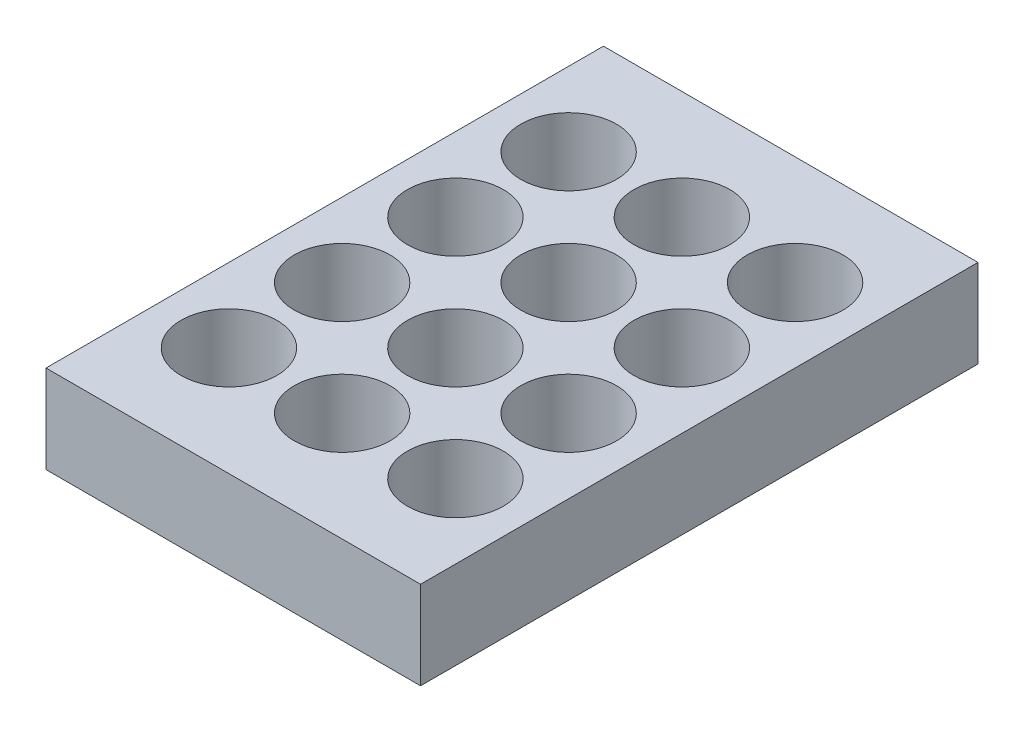
ISO-10303-21;
HEADER;
FILE_DESCRIPTION(('STEP AP214'),'2;1');
FILE_NAME('part.step','',(''),(''),'','','');
FILE_SCHEMA(('AUTOMOTIVE_DESIGN { 1 0 10303 214 1 1 1 1 }'));
ENDSEC;
DATA;
#1=APPLICATION_CONTEXT('core data for automotive mechanical design processes');
#2=APPLICATION_PROTOCOL_DEFINITION('international standard','automotive_design',2000,#1);
#3=PRODUCT_CONTEXT('',#1,'mechanical');
#4=PRODUCT('Part','Part','',(#3));
#5=PRODUCT_RELATED_PRODUCT_CATEGORY('part','',(#4));
#6=PRODUCT_DEFINITION_FORMATION('','',#4);
#7=PRODUCT_DEFINITION_CONTEXT('part definition',#1,'design');
#8=PRODUCT_DEFINITION('design','',#6,#7);
#9=PRODUCT_DEFINITION_SHAPE('','',#8);
#10=(LENGTH_UNIT() NAMED_UNIT(*) SI_UNIT(.MILLI.,.METRE.));
#11=(NAMED_UNIT(*) PLANE_ANGLE_UNIT() SI_UNIT($,.RADIAN.));
#12=(NAMED_UNIT(*) SI_UNIT($,.STERADIAN.) SOLID_ANGLE_UNIT());
#13=UNCERTAINTY_MEASURE_WITH_UNIT(LENGTH_MEASURE(1.E-05),#10,'distance_accuracy_value','');
#14=(GEOMETRIC_REPRESENTATION_CONTEXT(3) GLOBAL_UNCERTAINTY_ASSIGNED_CONTEXT((#13)) GLOBAL_UNIT_ASSIGNED_CONTEXT((#10,
#11,#12)) REPRESENTATION_CONTEXT('',''));
#15=CARTESIAN_POINT('',(0.,0.,0.));
#16=DIRECTION('',(0.,0.,1.));
#17=DIRECTION('',(1.,0.,0.));
#18=AXIS2_PLACEMENT_3D('',#15,#16,#17);
#19=CARTESIAN_POINT('',(69.,2.5,-103.));
#20=DIRECTION('',(0.,1.,0.));
#21=DIRECTION('',(0.,0.,1.));
#22=AXIS2_PLACEMENT_3D('',#19,#20,#21);
#23=PLANE('',#22);
#24=CARTESIAN_POINT('',(69.,2.5,-103.));
#25=DIRECTION('',(0.,1.,0.));
#26=DIRECTION('',(0.,0.,1.));
#27=AXIS2_PLACEMENT_3D('',#24,#25,#26);
#28=CIRCLE('',#27,11.);
#29=CARTESIAN_POINT('',(69.,2.5,-92.));
#30=VERTEX_POINT('',#29);
#31=EDGE_CURVE('E41',#30,#30,#28,.T.);
#32=ORIENTED_EDGE('',*,*,#31,.T.);
#33=EDGE_LOOP('',(#32));
#34=FACE_BOUND('',#33,.T.);
#35=ADVANCED_FACE('F33',(#34),#23,.T.);
#36=CARTESIAN_POINT('',(69.,2.5,-103.));
#37=DIRECTION('',(0.,1.,0.));
#38=DIRECTION('',(0.,0.,1.));
#39=AXIS2_PLACEMENT_3D('',#36,#37,#38);
#40=CYLINDRICAL_SURFACE('',#39,11.);
#41=ORIENTED_EDGE('',*,*,#31,.F.);
#42=EDGE_LOOP('',(#41));
#43=FACE_BOUND('',#42,.T.);
#44=CARTESIAN_POINT('',(69.,20.2,-103.));
#45=DIRECTION('',(0.,1.,0.));
#46=DIRECTION('',(0.,0.,1.));
#47=AXIS2_PLACEMENT_3D('',#44,#45,#46);
#48=CIRCLE('',#47,11.);
#49=CARTESIAN_POINT('',(69.,20.2,-92.));
#50=VERTEX_POINT('',#49);
#51=EDGE_CURVE('E11',#50,#50,#48,.T.);
#52=ORIENTED_EDGE('',*,*,#51,.T.);
#53=EDGE_LOOP('',(#52));
#54=FACE_BOUND('',#53,.T.);
#55=ADVANCED_FACE('F173',(#43,#54),#40,.F.);
#56=CARTESIAN_POINT('',(69.,2.5,-77.));
#57=DIRECTION('',(0.,1.,0.));
#58=DIRECTION('',(0.,0.,1.));
#59=AXIS2_PLACEMENT_3D('',#56,#57,#58);
#60=PLANE('',#59);
#61=CARTESIAN_POINT('',(69.,2.5,-77.));
#62=DIRECTION('',(0.,1.,0.));
#63=DIRECTION('',(0.,0.,1.));
#64=AXIS2_PLACEMENT_3D('',#61,#62,#63);
#65=CIRCLE('',#64,11.);
#66=CARTESIAN_POINT('',(69.,2.5,-66.));
#67=VERTEX_POINT('',#66);
#68=EDGE_CURVE('E164',#67,#67,#65,.T.);
#69=ORIENTED_EDGE('',*,*,#68,.T.);
#70=EDGE_LOOP('',(#69));
#71=FACE_BOUND('',#70,.T.);
#72=ADVANCED_FACE('F176',(#71),#60,.T.);
#73=CARTESIAN_POINT('',(69.,2.5,-77.));
#74=DIRECTION('',(0.,1.,0.));
#75=DIRECTION('',(0.,0.,1.));
#76=AXIS2_PLACEMENT_3D('',#73,#74,#75);
#77=CYLINDRICAL_SURFACE('',#76,11.);
#78=ORIENTED_EDGE('',*,*,#68,.F.);
#79=EDGE_LOOP('',(#78));
#80=FACE_BOUND('',#79,.T.);
#81=CARTESIAN_POINT('',(69.,20.2,-77.));
#82=DIRECTION('',(0.,1.,0.));
#83=DIRECTION('',(0.,0.,1.));
#84=AXIS2_PLACEMENT_3D('',#81,#82,#83);
#85=CIRCLE('',#84,11.);
#86=CARTESIAN_POINT('',(69.,20.2,-66.));
#87=VERTEX_POINT('',#86);
#88=EDGE_CURVE('E167',#87,#87,#85,.T.);
#89=ORIENTED_EDGE('',*,*,#88,.T.);
#90=EDGE_LOOP('',(#89));
#91=FACE_BOUND('',#90,.T.);
#92=ADVANCED_FACE('F239',(#80,#91),#77,.F.);
#93=CARTESIAN_POINT('',(69.,2.5,-51.));
#94=DIRECTION('',(0.,1.,0.));
#95=DIRECTION('',(0.,0.,1.));
#96=AXIS2_PLACEMENT_3D('',#93,#94,#95);
#97=PLANE('',#96);
#98=CARTESIAN_POINT('',(69.,2.5,-51.));
#99=DIRECTION('',(0.,1.,0.));
#100=DIRECTION('',(0.,0.,1.));
#101=AXIS2_PLACEMENT_3D('',#98,#99,#100);
#102=CIRCLE('',#101,11.);
#103=CARTESIAN_POINT('',(69.,2.5,-40.));
#104=VERTEX_POINT('',#103);
#105=EDGE_CURVE('E158',#104,#104,#102,.T.);
#106=ORIENTED_EDGE('',*,*,#105,.T.);
#107=EDGE_LOOP('',(#106));
#108=FACE_BOUND('',#107,.T.);
#109=ADVANCED_FACE('F247',(#108),#97,.T.);
#110=CARTESIAN_POINT('',(69.,2.5,-51.));
#111=DIRECTION('',(0.,1.,0.));
#112=DIRECTION('',(0.,0.,1.));
#113=AXIS2_PLACEMENT_3D('',#110,#111,#112);
#114=CYLINDRICAL_SURFACE('',#113,11.);
#115=ORIENTED_EDGE('',*,*,#105,.F.);
#116=EDGE_LOOP('',(#115));
#117=FACE_BOUND('',#116,.T.);
#118=CARTESIAN_POINT('',(69.,20.2,-51.));
#119=DIRECTION('',(0.,1.,0.));
#120=DIRECTION('',(0.,0.,1.));
#121=AXIS2_PLACEMENT_3D('',#118,#119,#120);
#122=CIRCLE('',#121,11.);
#123=CARTESIAN_POINT('',(69.,20.2,-40.));
#124=VERTEX_POINT('',#123);
#125=EDGE_CURVE('E161',#124,#124,#122,.T.);
#126=ORIENTED_EDGE('',*,*,#125,.T.);
#127=EDGE_LOOP('',(#126));
#128=FACE_BOUND('',#127,.T.);
#129=ADVANCED_FACE('F255',(#117,#128),#114,.F.);
#130=CARTESIAN_POINT('',(69.,2.5,-25.));
#131=DIRECTION('',(0.,1.,0.));
#132=DIRECTION('',(0.,0.,1.));
#133=AXIS2_PLACEMENT_3D('',#130,#131,#132);
#134=PLANE('',#133);
#135=CARTESIAN_POINT('',(69.,2.5,-25.));
#136=DIRECTION('',(0.,1.,0.));
#137=DIRECTION('',(0.,0.,1.));
#138=AXIS2_PLACEMENT_3D('',#135,#136,#137);
#139=CIRCLE('',#138,11.);
#140=CARTESIAN_POINT('',(69.,2.5,-14.));
#141=VERTEX_POINT('',#140);
#142=EDGE_CURVE('E152',#141,#141,#139,.T.);
#143=ORIENTED_EDGE('',*,*,#142,.T.);
#144=EDGE_LOOP('',(#143));
#145=FACE_BOUND('',#144,.T.);
#146=ADVANCED_FACE('F263',(#145),#134,.T.);
#147=CARTESIAN_POINT('',(69.,2.5,-25.));
#148=DIRECTION('',(0.,1.,0.));
#149=DIRECTION('',(0.,0.,1.));
#150=AXIS2_PLACEMENT_3D('',#147,#148,#149);
#151=CYLINDRICAL_SURFACE('',#150,11.);
#152=ORIENTED_EDGE('',*,*,#142,.F.);
#153=EDGE_LOOP('',(#152));
#154=FACE_BOUND('',#153,.T.);
#155=CARTESIAN_POINT('',(69.,20.2,-25.));
#156=DIRECTION('',(0.,1.,0.));
#157=DIRECTION('',(0.,0.,1.));
#158=AXIS2_PLACEMENT_3D('',#155,#156,#157);
#159=CIRCLE('',#158,11.);
#160=CARTESIAN_POINT('',(69.,20.2,-14.));
#161=VERTEX_POINT('',#160);
#162=EDGE_CURVE('E155',#161,#161,#159,.T.);
#163=ORIENTED_EDGE('',*,*,#162,.T.);
#164=EDGE_LOOP('',(#163));
#165=FACE_BOUND('',#164,.T.);
#166=ADVANCED_FACE('F271',(#154,#165),#151,.F.);
#167=CARTESIAN_POINT('',(43.,2.5,-103.));
#168=DIRECTION('',(0.,1.,0.));
#169=DIRECTION('',(0.,0.,1.));
#170=AXIS2_PLACEMENT_3D('',#167,#168,#169);
#171=PLANE('',#170);
#172=CARTESIAN_POINT('',(43.,2.5,-103.));
#173=DIRECTION('',(0.,1.,0.));
#174=DIRECTION('',(0.,0.,1.));
#175=AXIS2_PLACEMENT_3D('',#172,#173,#174);
#176=CIRCLE('',#175,11.);
#177=CARTESIAN_POINT('',(43.,2.5,-92.));
#178=VERTEX_POINT('',#177);
#179=EDGE_CURVE('E146',#178,#178,#176,.T.);
#180=ORIENTED_EDGE('',*,*,#179,.T.);
#181=EDGE_LOOP('',(#180));
#182=FACE_BOUND('',#181,.T.);
#183=ADVANCED_FACE('F279',(#182),#171,.T.);
#184=CARTESIAN_POINT('',(43.,2.5,-103.));
#185=DIRECTION('',(0.,1.,0.));
#186=DIRECTION('',(0.,0.,1.));
#187=AXIS2_PLACEMENT_3D('',#184,#185,#186);
#188=CYLINDRICAL_SURFACE('',#187,11.);
#189=ORIENTED_EDGE('',*,*,#179,.F.);
#190=EDGE_LOOP('',(#189));
#191=FACE_BOUND('',#190,.T.);
#192=CARTESIAN_POINT('',(43.,20.2,-103.));
#193=DIRECTION('',(0.,1.,0.));
#194=DIRECTION('',(0.,0.,1.));
#195=AXIS2_PLACEMENT_3D('',#192,#193,#194);
#196=CIRCLE('',#195,11.);
#197=CARTESIAN_POINT('',(43.,20.2,-92.));
#198=VERTEX_POINT('',#197);
#199=EDGE_CURVE('E149',#198,#198,#196,.T.);
#200=ORIENTED_EDGE('',*,*,#199,.T.);
#201=EDGE_LOOP('',(#200));
#202=FACE_BOUND('',#201,.T.);
#203=ADVANCED_FACE('F287',(#191,#202),#188,.F.);
#204=CARTESIAN_POINT('',(43.,2.5,-77.));
#205=DIRECTION('',(0.,1.,0.));
#206=DIRECTION('',(0.,0.,1.));
#207=AXIS2_PLACEMENT_3D('',#204,#205,#206);
#208=PLANE('',#207);
#209=CARTESIAN_POINT('',(43.,2.5,-77.));
#210=DIRECTION('',(0.,1.,0.));
#211=DIRECTION('',(0.,0.,1.));
#212=AXIS2_PLACEMENT_3D('',#209,#210,#211);
#213=CIRCLE('',#212,11.);
#214=CARTESIAN_POINT('',(43.,2.5,-66.));
#215=VERTEX_POINT('',#214);
#216=EDGE_CURVE('E140',#215,#215,#213,.T.);
#217=ORIENTED_EDGE('',*,*,#216,.T.);
#218=EDGE_LOOP('',(#217));
#219=FACE_BOUND('',#218,.T.);
#220=ADVANCED_FACE('F295',(#219),#208,.T.);
#221=CARTESIAN_POINT('',(43.,2.5,-77.));
#222=DIRECTION('',(0.,1.,0.));
#223=DIRECTION('',(0.,0.,1.));
#224=AXIS2_PLACEMENT_3D('',#221,#222,#223);
#225=CYLINDRICAL_SURFACE('',#224,11.);
#226=ORIENTED_EDGE('',*,*,#216,.F.);
#227=EDGE_LOOP('',(#226));
#228=FACE_BOUND('',#227,.T.);
#229=CARTESIAN_POINT('',(43.,20.2,-77.));
#230=DIRECTION('',(0.,1.,0.));
#231=DIRECTION('',(0.,0.,1.));
#232=AXIS2_PLACEMENT_3D('',#229,#230,#231);
#233=CIRCLE('',#232,11.);
#234=CARTESIAN_POINT('',(43.,20.2,-66.));
#235=VERTEX_POINT('',#234);
#236=EDGE_CURVE('E143',#235,#235,#233,.T.);
#237=ORIENTED_EDGE('',*,*,#236,.T.);
#238=EDGE_LOOP('',(#237));
#239=FACE_BOUND('',#238,.T.);
#240=ADVANCED_FACE('F303',(#228,#239),#225,.F.);
#241=CARTESIAN_POINT('',(43.,2.5,-51.));
#242=DIRECTION('',(0.,1.,0.));
#243=DIRECTION('',(0.,0.,1.));
#244=AXIS2_PLACEMENT_3D('',#241,#242,#243);
#245=PLANE('',#244);
#246=CARTESIAN_POINT('',(43.,2.5,-51.));
#247=DIRECTION('',(0.,1.,0.));
#248=DIRECTION('',(0.,0.,1.));
#249=AXIS2_PLACEMENT_3D('',#246,#247,#248);
#250=CIRCLE('',#249,11.);
#251=CARTESIAN_POINT('',(43.,2.5,-40.));
#252=VERTEX_POINT('',#251);
#253=EDGE_CURVE('E134',#252,#252,#250,.T.);
#254=ORIENTED_EDGE('',*,*,#253,.T.);
#255=EDGE_LOOP('',(#254));
#256=FACE_BOUND('',#255,.T.);
#257=ADVANCED_FACE('F311',(#256),#245,.T.);
#258=CARTESIAN_POINT('',(43.,2.5,-51.));
#259=DIRECTION('',(0.,1.,0.));
#260=DIRECTION('',(0.,0.,1.));
#261=AXIS2_PLACEMENT_3D('',#258,#259,#260);
#262=CYLINDRICAL_SURFACE('',#261,11.);
#263=ORIENTED_EDGE('',*,*,#253,.F.);
#264=EDGE_LOOP('',(#263));
#265=FACE_BOUND('',#264,.T.);
#266=CARTESIAN_POINT('',(43.,20.2,-51.));
#267=DIRECTION('',(0.,1.,0.));
#268=DIRECTION('',(0.,0.,1.));
#269=AXIS2_PLACEMENT_3D('',#266,#267,#268);
#270=CIRCLE('',#269,11.);
#271=CARTESIAN_POINT('',(43.,20.2,-40.));
#272=VERTEX_POINT('',#271);
#273=EDGE_CURVE('E137',#272,#272,#270,.T.);
#274=ORIENTED_EDGE('',*,*,#273,.T.);
#275=EDGE_LOOP('',(#274));
#276=FACE_BOUND('',#275,.T.);
#277=ADVANCED_FACE('F319',(#265,#276),#262,.F.);
#278=CARTESIAN_POINT('',(43.,2.5,-25.));
#279=DIRECTION('',(0.,1.,0.));
#280=DIRECTION('',(0.,0.,1.));
#281=AXIS2_PLACEMENT_3D('',#278,#279,#280);
#282=PLANE('',#281);
#283=CARTESIAN_POINT('',(43.,2.5,-25.));
#284=DIRECTION('',(0.,1.,0.));
#285=DIRECTION('',(0.,0.,1.));
#286=AXIS2_PLACEMENT_3D('',#283,#284,#285);
#287=CIRCLE('',#286,11.);
#288=CARTESIAN_POINT('',(43.,2.5,-14.));
#289=VERTEX_POINT('',#288);
#290=EDGE_CURVE('E128',#289,#289,#287,.T.);
#291=ORIENTED_EDGE('',*,*,#290,.T.);
#292=EDGE_LOOP('',(#291));
#293=FACE_BOUND('',#292,.T.);
#294=ADVANCED_FACE('F327',(#293),#282,.T.);
#295=CARTESIAN_POINT('',(43.,2.5,-25.));
#296=DIRECTION('',(0.,1.,0.));
#297=DIRECTION('',(0.,0.,1.));
#298=AXIS2_PLACEMENT_3D('',#295,#296,#297);
#299=CYLINDRICAL_SURFACE('',#298,11.);
#300=ORIENTED_EDGE('',*,*,#290,.F.);
#301=EDGE_LOOP('',(#300));
#302=FACE_BOUND('',#301,.T.);
#303=CARTESIAN_POINT('',(43.,20.2,-25.));
#304=DIRECTION('',(0.,1.,0.));
#305=DIRECTION('',(0.,0.,1.));
#306=AXIS2_PLACEMENT_3D('',#303,#304,#305);
#307=CIRCLE('',#306,11.);
#308=CARTESIAN_POINT('',(43.,20.2,-14.));
#309=VERTEX_POINT('',#308);
#310=EDGE_CURVE('E131',#309,#309,#307,.T.);
#311=ORIENTED_EDGE('',*,*,#310,.T.);
#312=EDGE_LOOP('',(#311));
#313=FACE_BOUND('',#312,.T.);
#314=ADVANCED_FACE('F335',(#302,#313),#299,.F.);
#315=CARTESIAN_POINT('',(17.,2.5,-103.));
#316=DIRECTION('',(0.,1.,0.));
#317=DIRECTION('',(0.,0.,1.));
#318=AXIS2_PLACEMENT_3D('',#315,#316,#317);
#319=PLANE('',#318);
#320=CARTESIAN_POINT('',(17.,2.5,-103.));
#321=DIRECTION('',(0.,1.,0.));
#322=DIRECTION('',(0.,0.,1.));
#323=AXIS2_PLACEMENT_3D('',#320,#321,#322);
#324=CIRCLE('',#323,11.);
#325=CARTESIAN_POINT('',(17.,2.5,-92.));
#326=VERTEX_POINT('',#325);
#327=EDGE_CURVE('E122',#326,#326,#324,.T.);
#328=ORIENTED_EDGE('',*,*,#327,.T.);
#329=EDGE_LOOP('',(#328));
#330=FACE_BOUND('',#329,.T.);
#331=ADVANCED_FACE('F343',(#330),#319,.T.);
#332=CARTESIAN_POINT('',(17.,2.5,-103.));
#333=DIRECTION('',(0.,1.,0.));
#334=DIRECTION('',(0.,0.,1.));
#335=AXIS2_PLACEMENT_3D('',#332,#333,#334);
#336=CYLINDRICAL_SURFACE('',#335,11.);
#337=ORIENTED_EDGE('',*,*,#327,.F.);
#338=EDGE_LOOP('',(#337));
#339=FACE_BOUND('',#338,.T.);
#340=CARTESIAN_POINT('',(17.,20.2,-103.));
#341=DIRECTION('',(0.,1.,0.));
#342=DIRECTION('',(0.,0.,1.));
#343=AXIS2_PLACEMENT_3D('',#340,#341,#342);
#344=CIRCLE('',#343,11.);
#345=CARTESIAN_POINT('',(17.,20.2,-92.));
#346=VERTEX_POINT('',#345);
#347=EDGE_CURVE('E125',#346,#346,#344,.T.);
#348=ORIENTED_EDGE('',*,*,#347,.T.);
#349=EDGE_LOOP('',(#348));
#350=FACE_BOUND('',#349,.T.);
#351=ADVANCED_FACE('F351',(#339,#350),#336,.F.);
#352=CARTESIAN_POINT('',(17.,2.5,-77.));
#353=DIRECTION('',(0.,1.,0.));
#354=DIRECTION('',(0.,0.,1.));
#355=AXIS2_PLACEMENT_3D('',#352,#353,#354);
#356=PLANE('',#355);
#357=CARTESIAN_POINT('',(17.,2.5,-77.));
#358=DIRECTION('',(0.,1.,0.));
#359=DIRECTION('',(0.,0.,1.));
#360=AXIS2_PLACEMENT_3D('',#357,#358,#359);
#361=CIRCLE('',#360,11.);
#362=CARTESIAN_POINT('',(17.,2.5,-66.));
#363=VERTEX_POINT('',#362);
#364=EDGE_CURVE('E116',#363,#363,#361,.T.);
#365=ORIENTED_EDGE('',*,*,#364,.T.);
#366=EDGE_LOOP('',(#365));
#367=FACE_BOUND('',#366,.T.);
#368=ADVANCED_FACE('F359',(#367),#356,.T.);
#369=CARTESIAN_POINT('',(17.,2.5,-77.));
#370=DIRECTION('',(0.,1.,0.));
#371=DIRECTION('',(0.,0.,1.));
#372=AXIS2_PLACEMENT_3D('',#369,#370,#371);
#373=CYLINDRICAL_SURFACE('',#372,11.);
#374=ORIENTED_EDGE('',*,*,#364,.F.);
#375=EDGE_LOOP('',(#374));
#376=FACE_BOUND('',#375,.T.);
#377=CARTESIAN_POINT('',(17.,20.2,-77.));
#378=DIRECTION('',(0.,1.,0.));
#379=DIRECTION('',(0.,0.,1.));
#380=AXIS2_PLACEMENT_3D('',#377,#378,#379);
#381=CIRCLE('',#380,11.);
#382=CARTESIAN_POINT('',(17.,20.2,-66.));
#383=VERTEX_POINT('',#382);
#384=EDGE_CURVE('E119',#383,#383,#381,.T.);
#385=ORIENTED_EDGE('',*,*,#384,.T.);
#386=EDGE_LOOP('',(#385));
#387=FACE_BOUND('',#386,.T.);
#388=ADVANCED_FACE('F367',(#376,#387),#373,.F.);
#389=CARTESIAN_POINT('',(17.,2.5,-51.));
#390=DIRECTION('',(0.,1.,0.));
#391=DIRECTION('',(0.,0.,1.));
#392=AXIS2_PLACEMENT_3D('',#389,#390,#391);
#393=PLANE('',#392);
#394=CARTESIAN_POINT('',(17.,2.5,-51.));
#395=DIRECTION('',(0.,1.,0.));
#396=DIRECTION('',(0.,0.,1.));
#397=AXIS2_PLACEMENT_3D('',#394,#395,#396);
#398=CIRCLE('',#397,11.);
#399=CARTESIAN_POINT('',(17.,2.5,-40.));
#400=VERTEX_POINT('',#399);
#401=EDGE_CURVE('E110',#400,#400,#398,.T.);
#402=ORIENTED_EDGE('',*,*,#401,.T.);
#403=EDGE_LOOP('',(#402));
#404=FACE_BOUND('',#403,.T.);
#405=ADVANCED_FACE('F375',(#404),#393,.T.);
#406=CARTESIAN_POINT('',(17.,2.5,-51.));
#407=DIRECTION('',(0.,1.,0.));
#408=DIRECTION('',(0.,0.,1.));
#409=AXIS2_PLACEMENT_3D('',#406,#407,#408);
#410=CYLINDRICAL_SURFACE('',#409,11.);
#411=ORIENTED_EDGE('',*,*,#401,.F.);
#412=EDGE_LOOP('',(#411));
#413=FACE_BOUND('',#412,.T.);
#414=CARTESIAN_POINT('',(17.,20.2,-51.));
#415=DIRECTION('',(0.,1.,0.));
#416=DIRECTION('',(0.,0.,1.));
#417=AXIS2_PLACEMENT_3D('',#414,#415,#416);
#418=CIRCLE('',#417,11.);
#419=CARTESIAN_POINT('',(17.,20.2,-40.));
#420=VERTEX_POINT('',#419);
#421=EDGE_CURVE('E113',#420,#420,#418,.T.);
#422=ORIENTED_EDGE('',*,*,#421,.T.);
#423=EDGE_LOOP('',(#422));
#424=FACE_BOUND('',#423,.T.);
#425=ADVANCED_FACE('F383',(#413,#424),#410,.F.);
#426=CARTESIAN_POINT('',(0.,20.2,0.));
#427=DIRECTION('',(1.,0.,0.));
#428=DIRECTION('',(0.,0.,-1.));
#429=AXIS2_PLACEMENT_3D('',#426,#427,#428);
#430=PLANE('',#429);
#431=DIRECTION('',(0.,0.,1.));
#432=VECTOR('',#431,1.);
#433=CARTESIAN_POINT('',(0.,0.,0.));
#434=LINE('',#433,#432);
#435=CARTESIAN_POINT('',(0.,0.,-128.));
#436=VERTEX_POINT('',#435);
#437=CARTESIAN_POINT('',(0.,0.,0.));
#438=VERTEX_POINT('',#437);
#439=EDGE_CURVE('E100',#436,#438,#434,.T.);
#440=ORIENTED_EDGE('',*,*,#439,.T.);
#441=DIRECTION('',(0.,-1.,0.));
#442=VECTOR('',#441,1.);
#443=CARTESIAN_POINT('',(0.,20.2,0.));
#444=LINE('',#443,#442);
#445=CARTESIAN_POINT('',(0.,20.2,0.));
#446=VERTEX_POINT('',#445);
#447=EDGE_CURVE('E91',#446,#438,#444,.T.);
#448=ORIENTED_EDGE('',*,*,#447,.F.);
#449=DIRECTION('',(0.,0.,1.));
#450=VECTOR('',#449,1.);
#451=CARTESIAN_POINT('',(0.,20.2,0.));
#452=LINE('',#451,#450);
#453=CARTESIAN_POINT('',(0.,20.2,-128.));
#454=VERTEX_POINT('',#453);
#455=EDGE_CURVE('E85',#454,#446,#452,.T.);
#456=ORIENTED_EDGE('',*,*,#455,.F.);
#457=DIRECTION('',(0.,-1.,0.));
#458=VECTOR('',#457,1.);
#459=CARTESIAN_POINT('',(0.,20.2,-128.));
#460=LINE('',#459,#458);
#461=EDGE_CURVE('E96',#454,#436,#460,.T.);
#462=ORIENTED_EDGE('',*,*,#461,.T.);
#463=EDGE_LOOP('',(#440,#448,#456,#462));
#464=FACE_BOUND('',#463,.T.);
#465=ADVANCED_FACE('F391',(#464),#430,.F.);
#466=CARTESIAN_POINT('',(0.,20.2,0.));
#467=DIRECTION('',(0.,0.,-1.));
#468=DIRECTION('',(-1.,0.,0.));
#469=AXIS2_PLACEMENT_3D('',#466,#467,#468);
#470=PLANE('',#469);
#471=DIRECTION('',(1.,0.,0.));
#472=VECTOR('',#471,1.);
#473=CARTESIAN_POINT('',(0.,0.,0.));
#474=LINE('',#473,#472);
#475=CARTESIAN_POINT('',(86.,0.,0.));
#476=VERTEX_POINT('',#475);
#477=EDGE_CURVE('E90',#438,#476,#474,.T.);
#478=ORIENTED_EDGE('',*,*,#477,.T.);
#479=DIRECTION('',(0.,-1.,0.));
#480=VECTOR('',#479,1.);
#481=CARTESIAN_POINT('',(86.,20.2,0.));
#482=LINE('',#481,#480);
#483=CARTESIAN_POINT('',(86.,20.2,0.));
#484=VERTEX_POINT('',#483);
#485=EDGE_CURVE('E88',#484,#476,#482,.T.);
#486=ORIENTED_EDGE('',*,*,#485,.F.);
#487=DIRECTION('',(1.,0.,0.));
#488=VECTOR('',#487,1.);
#489=CARTESIAN_POINT('',(0.,20.2,0.));
#490=LINE('',#489,#488);
#491=EDGE_CURVE('E80',#446,#484,#490,.T.);
#492=ORIENTED_EDGE('',*,*,#491,.F.);
#493=ORIENTED_EDGE('',*,*,#447,.T.);
#494=EDGE_LOOP('',(#478,#486,#492,#493));
#495=FACE_BOUND('',#494,.T.);
#496=ADVANCED_FACE('F89',(#495),#470,.F.);
#497=CARTESIAN_POINT('',(86.,20.2,0.));
#498=DIRECTION('',(-1.,0.,0.));
#499=DIRECTION('',(0.,0.,1.));
#500=AXIS2_PLACEMENT_3D('',#497,#498,#499);
#501=PLANE('',#500);
#502=DIRECTION('',(0.,0.,-1.));
#503=VECTOR('',#502,1.);
#504=CARTESIAN_POINT('',(86.,0.,0.));
#505=LINE('',#504,#503);
#506=CARTESIAN_POINT('',(86.,0.,-128.));
#507=VERTEX_POINT('',#506);
#508=EDGE_CURVE('E66',#476,#507,#505,.T.);
#509=ORIENTED_EDGE('',*,*,#508,.T.);
#510=DIRECTION('',(0.,-1.,0.));
#511=VECTOR('',#510,1.);
#512=CARTESIAN_POINT('',(86.,20.2,-128.));
#513=LINE('',#512,#511);
#514=CARTESIAN_POINT('',(86.,20.2,-128.));
#515=VERTEX_POINT('',#514);
#516=EDGE_CURVE('E92',#515,#507,#513,.T.);
#517=ORIENTED_EDGE('',*,*,#516,.F.);
#518=DIRECTION('',(0.,0.,-1.));
#519=VECTOR('',#518,1.);
#520=CARTESIAN_POINT('',(86.,20.2,0.));
#521=LINE('',#520,#519);
#522=EDGE_CURVE('E83',#484,#515,#521,.T.);
#523=ORIENTED_EDGE('',*,*,#522,.F.);
#524=ORIENTED_EDGE('',*,*,#485,.T.);
#525=EDGE_LOOP('',(#509,#517,#523,#524));
#526=FACE_BOUND('',#525,.T.);
#527=ADVANCED_FACE('F94',(#526),#501,.F.);
#528=CARTESIAN_POINT('',(0.,20.2,-128.));
#529=DIRECTION('',(0.,0.,1.));
#530=DIRECTION('',(1.,0.,0.));
#531=AXIS2_PLACEMENT_3D('',#528,#529,#530);
#532=PLANE('',#531);
#533=DIRECTION('',(-1.,0.,0.));
#534=VECTOR('',#533,1.);
#535=CARTESIAN_POINT('',(0.,0.,-128.));
#536=LINE('',#535,#534);
#537=EDGE_CURVE('E72',#507,#436,#536,.T.);
#538=ORIENTED_EDGE('',*,*,#537,.T.);
#539=ORIENTED_EDGE('',*,*,#461,.F.);
#540=DIRECTION('',(-1.,0.,0.));
#541=VECTOR('',#540,1.);
#542=CARTESIAN_POINT('',(0.,20.2,-128.));
#543=LINE('',#542,#541);
#544=EDGE_CURVE('E49',#515,#454,#543,.T.);
#545=ORIENTED_EDGE('',*,*,#544,.F.);
#546=ORIENTED_EDGE('',*,*,#516,.T.);
#547=EDGE_LOOP('',(#538,#539,#545,#546));
#548=FACE_BOUND('',#547,.T.);
#549=ADVANCED_FACE('F182',(#548),#532,.F.);
#550=CARTESIAN_POINT('',(0.,20.2,0.));
#551=DIRECTION('',(0.,-1.,0.));
#552=DIRECTION('',(0.,0.,-1.));
#553=AXIS2_PLACEMENT_3D('',#550,#551,#552);
#554=PLANE('',#553);
#555=ORIENTED_EDGE('',*,*,#51,.F.);
#556=EDGE_LOOP('',(#555));
#557=FACE_BOUND('',#556,.T.);
#558=ORIENTED_EDGE('',*,*,#88,.F.);
#559=EDGE_LOOP('',(#558));
#560=FACE_BOUND('',#559,.T.);
#561=ORIENTED_EDGE('',*,*,#125,.F.);
#562=EDGE_LOOP('',(#561));
#563=FACE_BOUND('',#562,.T.);
#564=ORIENTED_EDGE('',*,*,#162,.F.);
#565=EDGE_LOOP('',(#564));
#566=FACE_BOUND('',#565,.T.);
#567=ORIENTED_EDGE('',*,*,#199,.F.);
#568=EDGE_LOOP('',(#567));
#569=FACE_BOUND('',#568,.T.);
#570=ORIENTED_EDGE('',*,*,#236,.F.);
#571=EDGE_LOOP('',(#570));
#572=FACE_BOUND('',#571,.T.);
#573=ORIENTED_EDGE('',*,*,#273,.F.);
#574=EDGE_LOOP('',(#573));
#575=FACE_BOUND('',#574,.T.);
#576=ORIENTED_EDGE('',*,*,#310,.F.);
#577=EDGE_LOOP('',(#576));
#578=FACE_BOUND('',#577,.T.);
#579=ORIENTED_EDGE('',*,*,#347,.F.);
#580=EDGE_LOOP('',(#579));
#581=FACE_BOUND('',#580,.T.);
#582=ORIENTED_EDGE('',*,*,#384,.F.);
#583=EDGE_LOOP('',(#582));
#584=FACE_BOUND('',#583,.T.);
#585=ORIENTED_EDGE('',*,*,#421,.F.);
#586=EDGE_LOOP('',(#585));
#587=FACE_BOUND('',#586,.T.);
#588=CARTESIAN_POINT('',(17.,20.2,-25.));
#589=DIRECTION('',(0.,1.,0.));
#590=DIRECTION('',(0.,0.,1.));
#591=AXIS2_PLACEMENT_3D('',#588,#589,#590);
#592=CIRCLE('',#591,11.);
#593=CARTESIAN_POINT('',(17.,20.2,-14.));
#594=VERTEX_POINT('',#593);
#595=EDGE_CURVE('E206',#594,#594,#592,.T.);
#596=ORIENTED_EDGE('',*,*,#595,.F.);
#597=EDGE_LOOP('',(#596));
#598=FACE_BOUND('',#597,.T.);
#599=ORIENTED_EDGE('',*,*,#455,.T.);
#600=ORIENTED_EDGE('',*,*,#491,.T.);
#601=ORIENTED_EDGE('',*,*,#522,.T.);
#602=ORIENTED_EDGE('',*,*,#544,.T.);
#603=EDGE_LOOP('',(#599,#600,#601,#602));
#604=FACE_BOUND('',#603,.T.);
#605=ADVANCED_FACE('F81',(#557,#560,#563,#566,#569,#572,#575,#578,#581,#584,#587,#598,#604),
#554,.F.);
#606=CARTESIAN_POINT('',(0.,0.,0.));
#607=DIRECTION('',(0.,-1.,0.));
#608=DIRECTION('',(0.,0.,-1.));
#609=AXIS2_PLACEMENT_3D('',#606,#607,#608);
#610=PLANE('',#609);
#611=ORIENTED_EDGE('',*,*,#439,.F.);
#612=ORIENTED_EDGE('',*,*,#537,.F.);
#613=ORIENTED_EDGE('',*,*,#508,.F.);
#614=ORIENTED_EDGE('',*,*,#477,.F.);
#615=EDGE_LOOP('',(#611,#612,#613,#614));
#616=FACE_BOUND('',#615,.T.);
#617=ADVANCED_FACE('F181',(#616),#610,.T.);
#618=CARTESIAN_POINT('',(17.,2.5,-25.));
#619=DIRECTION('',(0.,1.,0.));
#620=DIRECTION('',(0.,0.,1.));
#621=AXIS2_PLACEMENT_3D('',#618,#619,#620);
#622=CYLINDRICAL_SURFACE('',#621,11.);
#623=CARTESIAN_POINT('',(17.,2.5,-25.));
#624=DIRECTION('',(0.,1.,0.));
#625=DIRECTION('',(0.,0.,1.));
#626=AXIS2_PLACEMENT_3D('',#623,#624,#625);
#627=CIRCLE('',#626,11.);
#628=CARTESIAN_POINT('',(17.,2.5,-14.));
#629=VERTEX_POINT('',#628);
#630=EDGE_CURVE('E103',#629,#629,#627,.T.);
#631=ORIENTED_EDGE('',*,*,#630,.F.);
#632=EDGE_LOOP('',(#631));
#633=FACE_BOUND('',#632,.T.);
#634=ORIENTED_EDGE('',*,*,#595,.T.);
#635=EDGE_LOOP('',(#634));
#636=FACE_BOUND('',#635,.T.);
#637=ADVANCED_FACE('F215',(#633,#636),#622,.F.);
#638=CARTESIAN_POINT('',(17.,2.5,-25.));
#639=DIRECTION('',(0.,1.,0.));
#640=DIRECTION('',(0.,0.,1.));
#641=AXIS2_PLACEMENT_3D('',#638,#639,#640);
#642=PLANE('',#641);
#643=ORIENTED_EDGE('',*,*,#630,.T.);
#644=EDGE_LOOP('',(#643));
#645=FACE_BOUND('',#644,.T.);
#646=ADVANCED_FACE('F213',(#645),#642,.T.);
#647=CLOSED_SHELL('',(#35,#55,#72,#92,#109,#129,#146,#166,#183,#203,#220,#240,#257,#277,#294,
#314,#331,#351,#368,#388,#405,#425,#465,#496,#527,#549,#605,#617,#637,#646));
#648=MANIFOLD_SOLID_BREP('B2',#647);
#649=ADVANCED_BREP_SHAPE_REPRESENTATION('',(#18,#648),#14);
#650=SHAPE_DEFINITION_REPRESENTATION(#9,#649);
ENDSEC;
END-ISO-10303-21;
